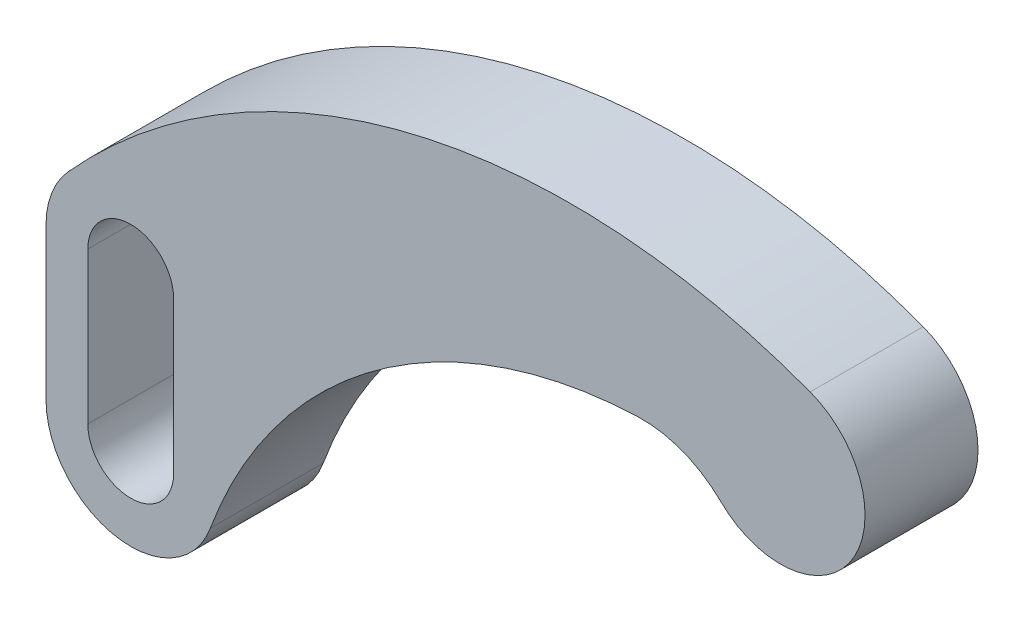
ISO-10303-21;
HEADER;
FILE_DESCRIPTION(('STEP AP214'),'2;1');
FILE_NAME('part.step','',(''),(''),'','','');
FILE_SCHEMA(('AUTOMOTIVE_DESIGN { 1 0 10303 214 1 1 1 1 }'));
ENDSEC;
DATA;
#1=APPLICATION_CONTEXT('core data for automotive mechanical design processes');
#2=APPLICATION_PROTOCOL_DEFINITION('international standard','automotive_design',2000,#1);
#3=PRODUCT_CONTEXT('',#1,'mechanical');
#4=PRODUCT('Part','Part','',(#3));
#5=PRODUCT_RELATED_PRODUCT_CATEGORY('part','',(#4));
#6=PRODUCT_DEFINITION_FORMATION('','',#4);
#7=PRODUCT_DEFINITION_CONTEXT('part definition',#1,'design');
#8=PRODUCT_DEFINITION('design','',#6,#7);
#9=PRODUCT_DEFINITION_SHAPE('','',#8);
#10=(LENGTH_UNIT() NAMED_UNIT(*) SI_UNIT(.MILLI.,.METRE.));
#11=(NAMED_UNIT(*) PLANE_ANGLE_UNIT() SI_UNIT($,.RADIAN.));
#12=(NAMED_UNIT(*) SI_UNIT($,.STERADIAN.) SOLID_ANGLE_UNIT());
#13=UNCERTAINTY_MEASURE_WITH_UNIT(LENGTH_MEASURE(1.E-05),#10,'distance_accuracy_value','');
#14=(GEOMETRIC_REPRESENTATION_CONTEXT(3) GLOBAL_UNCERTAINTY_ASSIGNED_CONTEXT((#13)) GLOBAL_UNIT_ASSIGNED_CONTEXT((#10,
#11,#12)) REPRESENTATION_CONTEXT('',''));
#15=CARTESIAN_POINT('',(0.,0.,0.));
#16=DIRECTION('',(0.,0.,1.));
#17=DIRECTION('',(1.,0.,0.));
#18=AXIS2_PLACEMENT_3D('',#15,#16,#17);
#19=CARTESIAN_POINT('',(-31.1085197333464,-31.75,25.4));
#20=DIRECTION('',(0.,0.,1.));
#21=DIRECTION('',(1.,0.,0.));
#22=AXIS2_PLACEMENT_3D('',#19,#20,#21);
#23=PLANE('',#22);
#24=CARTESIAN_POINT('',(-31.1085197333464,-31.75,25.4));
#25=DIRECTION('',(0.,0.,-1.));
#26=DIRECTION('',(1.,0.,0.));
#27=AXIS2_PLACEMENT_3D('',#24,#25,#26);
#28=CIRCLE('',#27,25.4);
#29=CARTESIAN_POINT('',(-32.0676878720464,-6.36811676644734,25.4));
#30=VERTEX_POINT('',#29);
#31=CARTESIAN_POINT('',(-13.3322227428627,-13.6071428571429,25.4));
#32=VERTEX_POINT('',#31);
#33=EDGE_CURVE('E171',#30,#32,#28,.T.);
#34=ORIENTED_EDGE('',*,*,#33,.T.);
#35=CARTESIAN_POINT('',(0.,0.,25.4));
#36=DIRECTION('',(0.,0.,1.));
#37=DIRECTION('',(1.,0.,0.));
#38=AXIS2_PLACEMENT_3D('',#35,#36,#37);
#39=CIRCLE('',#38,19.05);
#40=CARTESIAN_POINT('',(6.70952497409267,17.8293234482419,25.4));
#41=VERTEX_POINT('',#40);
#42=EDGE_CURVE('E175',#32,#41,#39,.T.);
#43=ORIENTED_EDGE('',*,*,#42,.T.);
#44=CARTESIAN_POINT('',(-46.9666748186486,-124.805264137693,25.4));
#45=DIRECTION('',(0.,0.,1.));
#46=DIRECTION('',(1.,0.,0.));
#47=AXIS2_PLACEMENT_3D('',#44,#45,#46);
#48=CIRCLE('',#47,152.4);
#49=CARTESIAN_POINT('',(-160.204760740193,-22.8106765517582,25.4));
#50=VERTEX_POINT('',#49);
#51=EDGE_CURVE('E179',#41,#50,#48,.T.);
#52=ORIENTED_EDGE('',*,*,#51,.T.);
#53=CARTESIAN_POINT('',(-146.05,-35.56,25.4));
#54=DIRECTION('',(0.,0.,1.));
#55=DIRECTION('',(1.,0.,0.));
#56=AXIS2_PLACEMENT_3D('',#53,#54,#55);
#57=CIRCLE('',#56,19.05);
#58=CARTESIAN_POINT('',(-165.1,-35.56,25.4));
#59=VERTEX_POINT('',#58);
#60=EDGE_CURVE('E182',#50,#59,#57,.T.);
#61=ORIENTED_EDGE('',*,*,#60,.T.);
#62=DIRECTION('',(0.,-1.,0.));
#63=VECTOR('',#62,1.);
#64=CARTESIAN_POINT('',(-165.1,-69.596,25.4));
#65=LINE('',#64,#63);
#66=CARTESIAN_POINT('',(-165.1,-69.596,25.4));
#67=VERTEX_POINT('',#66);
#68=EDGE_CURVE('E185',#59,#67,#65,.T.);
#69=ORIENTED_EDGE('',*,*,#68,.T.);
#70=CARTESIAN_POINT('',(-146.05,-69.596,25.4));
#71=DIRECTION('',(0.,0.,1.));
#72=DIRECTION('',(1.,0.,0.));
#73=AXIS2_PLACEMENT_3D('',#70,#71,#72);
#74=CIRCLE('',#73,19.05);
#75=CARTESIAN_POINT('',(-128.169572983258,-76.1681252041468,25.4));
#76=VERTEX_POINT('',#75);
#77=EDGE_CURVE('E188',#67,#76,#74,.T.);
#78=ORIENTED_EDGE('',*,*,#77,.T.);
#79=CARTESIAN_POINT('',(-28.0391816895061,-112.972026347369,25.4));
#80=DIRECTION('',(0.,0.,-1.));
#81=DIRECTION('',(1.,0.,0.));
#82=AXIS2_PLACEMENT_3D('',#79,#80,#81);
#83=CIRCLE('',#82,106.68);
#84=EDGE_CURVE('E191',#76,#30,#83,.T.);
#85=ORIENTED_EDGE('',*,*,#84,.T.);
#86=EDGE_LOOP('',(#34,#43,#52,#61,#69,#78,#85));
#87=FACE_BOUND('',#86,.T.);
#88=DIRECTION('',(0.,-1.,0.));
#89=VECTOR('',#88,1.);
#90=CARTESIAN_POINT('',(-155.702,-35.56,25.4));
#91=LINE('',#90,#89);
#92=CARTESIAN_POINT('',(-155.702,-35.56,25.4));
#93=VERTEX_POINT('',#92);
#94=CARTESIAN_POINT('',(-155.702,-69.596,25.4));
#95=VERTEX_POINT('',#94);
#96=EDGE_CURVE('E132',#93,#95,#91,.T.);
#97=ORIENTED_EDGE('',*,*,#96,.F.);
#98=CARTESIAN_POINT('',(-146.05,-35.56,25.4));
#99=DIRECTION('',(0.,0.,1.));
#100=DIRECTION('',(1.,0.,0.));
#101=AXIS2_PLACEMENT_3D('',#98,#99,#100);
#102=CIRCLE('',#101,9.65199999999999);
#103=CARTESIAN_POINT('',(-136.398,-35.56,25.4));
#104=VERTEX_POINT('',#103);
#105=EDGE_CURVE('E123',#104,#93,#102,.T.);
#106=ORIENTED_EDGE('',*,*,#105,.F.);
#107=DIRECTION('',(0.,1.,0.));
#108=VECTOR('',#107,1.);
#109=CARTESIAN_POINT('',(-136.398,-35.56,25.4));
#110=LINE('',#109,#108);
#111=CARTESIAN_POINT('',(-136.398,-69.596,25.4));
#112=VERTEX_POINT('',#111);
#113=EDGE_CURVE('E149',#112,#104,#110,.T.);
#114=ORIENTED_EDGE('',*,*,#113,.F.);
#115=CARTESIAN_POINT('',(-146.05,-69.596,25.4));
#116=DIRECTION('',(0.,0.,1.));
#117=DIRECTION('',(1.,0.,0.));
#118=AXIS2_PLACEMENT_3D('',#115,#116,#117);
#119=CIRCLE('',#118,9.65199999999999);
#120=EDGE_CURVE('E145',#95,#112,#119,.T.);
#121=ORIENTED_EDGE('',*,*,#120,.F.);
#122=EDGE_LOOP('',(#97,#106,#114,#121));
#123=FACE_BOUND('',#122,.T.);
#124=ADVANCED_FACE('F39',(#87,#123),#23,.T.);
#125=CARTESIAN_POINT('',(-31.1085197333464,-31.75,0.));
#126=DIRECTION('',(0.,0.,1.));
#127=DIRECTION('',(1.,0.,0.));
#128=AXIS2_PLACEMENT_3D('',#125,#126,#127);
#129=PLANE('',#128);
#130=CARTESIAN_POINT('',(-31.1085197333464,-31.75,0.));
#131=DIRECTION('',(0.,0.,-1.));
#132=DIRECTION('',(1.,0.,0.));
#133=AXIS2_PLACEMENT_3D('',#130,#131,#132);
#134=CIRCLE('',#133,25.4);
#135=CARTESIAN_POINT('',(-32.0676878720464,-6.36811676644734,0.));
#136=VERTEX_POINT('',#135);
#137=CARTESIAN_POINT('',(-13.3322227428627,-13.6071428571429,0.));
#138=VERTEX_POINT('',#137);
#139=EDGE_CURVE('E141',#136,#138,#134,.T.);
#140=ORIENTED_EDGE('',*,*,#139,.F.);
#141=CARTESIAN_POINT('',(-28.0391816895061,-112.972026347369,0.));
#142=DIRECTION('',(0.,0.,-1.));
#143=DIRECTION('',(1.,0.,0.));
#144=AXIS2_PLACEMENT_3D('',#141,#142,#143);
#145=CIRCLE('',#144,106.68);
#146=CARTESIAN_POINT('',(-128.169572983258,-76.1681252041468,0.));
#147=VERTEX_POINT('',#146);
#148=EDGE_CURVE('E176',#147,#136,#145,.T.);
#149=ORIENTED_EDGE('',*,*,#148,.F.);
#150=CARTESIAN_POINT('',(-146.05,-69.596,0.));
#151=DIRECTION('',(0.,0.,1.));
#152=DIRECTION('',(1.,0.,0.));
#153=AXIS2_PLACEMENT_3D('',#150,#151,#152);
#154=CIRCLE('',#153,19.05);
#155=CARTESIAN_POINT('',(-165.1,-69.596,0.));
#156=VERTEX_POINT('',#155);
#157=EDGE_CURVE('E210',#156,#147,#154,.T.);
#158=ORIENTED_EDGE('',*,*,#157,.F.);
#159=DIRECTION('',(0.,-1.,0.));
#160=VECTOR('',#159,1.);
#161=CARTESIAN_POINT('',(-165.1,-69.596,0.));
#162=LINE('',#161,#160);
#163=CARTESIAN_POINT('',(-165.1,-35.56,0.));
#164=VERTEX_POINT('',#163);
#165=EDGE_CURVE('E207',#164,#156,#162,.T.);
#166=ORIENTED_EDGE('',*,*,#165,.F.);
#167=CARTESIAN_POINT('',(-146.05,-35.56,0.));
#168=DIRECTION('',(0.,0.,1.));
#169=DIRECTION('',(1.,0.,0.));
#170=AXIS2_PLACEMENT_3D('',#167,#168,#169);
#171=CIRCLE('',#170,19.05);
#172=CARTESIAN_POINT('',(-160.204760740193,-22.8106765517582,0.));
#173=VERTEX_POINT('',#172);
#174=EDGE_CURVE('E204',#173,#164,#171,.T.);
#175=ORIENTED_EDGE('',*,*,#174,.F.);
#176=CARTESIAN_POINT('',(-46.9666748186486,-124.805264137693,0.));
#177=DIRECTION('',(0.,0.,1.));
#178=DIRECTION('',(1.,0.,0.));
#179=AXIS2_PLACEMENT_3D('',#176,#177,#178);
#180=CIRCLE('',#179,152.4);
#181=CARTESIAN_POINT('',(6.70952497409267,17.8293234482419,0.));
#182=VERTEX_POINT('',#181);
#183=EDGE_CURVE('E201',#182,#173,#180,.T.);
#184=ORIENTED_EDGE('',*,*,#183,.F.);
#185=CARTESIAN_POINT('',(0.,0.,0.));
#186=DIRECTION('',(0.,0.,1.));
#187=DIRECTION('',(1.,0.,0.));
#188=AXIS2_PLACEMENT_3D('',#185,#186,#187);
#189=CIRCLE('',#188,19.05);
#190=EDGE_CURVE('E198',#138,#182,#189,.T.);
#191=ORIENTED_EDGE('',*,*,#190,.F.);
#192=EDGE_LOOP('',(#140,#149,#158,#166,#175,#184,#191));
#193=FACE_BOUND('',#192,.T.);
#194=CARTESIAN_POINT('',(-146.05,-35.56,0.));
#195=DIRECTION('',(0.,0.,1.));
#196=DIRECTION('',(1.,0.,0.));
#197=AXIS2_PLACEMENT_3D('',#194,#195,#196);
#198=CIRCLE('',#197,9.65199999999999);
#199=CARTESIAN_POINT('',(-136.398,-35.56,0.));
#200=VERTEX_POINT('',#199);
#201=CARTESIAN_POINT('',(-155.702,-35.56,0.));
#202=VERTEX_POINT('',#201);
#203=EDGE_CURVE('E63',#200,#202,#198,.T.);
#204=ORIENTED_EDGE('',*,*,#203,.T.);
#205=DIRECTION('',(0.,-1.,0.));
#206=VECTOR('',#205,1.);
#207=CARTESIAN_POINT('',(-155.702,-35.56,0.));
#208=LINE('',#207,#206);
#209=CARTESIAN_POINT('',(-155.702,-69.596,0.));
#210=VERTEX_POINT('',#209);
#211=EDGE_CURVE('E139',#202,#210,#208,.T.);
#212=ORIENTED_EDGE('',*,*,#211,.T.);
#213=CARTESIAN_POINT('',(-146.05,-69.596,0.));
#214=DIRECTION('',(0.,0.,1.));
#215=DIRECTION('',(1.,0.,0.));
#216=AXIS2_PLACEMENT_3D('',#213,#214,#215);
#217=CIRCLE('',#216,9.65199999999999);
#218=CARTESIAN_POINT('',(-136.398,-69.596,0.));
#219=VERTEX_POINT('',#218);
#220=EDGE_CURVE('E158',#210,#219,#217,.T.);
#221=ORIENTED_EDGE('',*,*,#220,.T.);
#222=DIRECTION('',(0.,1.,0.));
#223=VECTOR('',#222,1.);
#224=CARTESIAN_POINT('',(-136.398,-35.56,0.));
#225=LINE('',#224,#223);
#226=EDGE_CURVE('E133',#219,#200,#225,.T.);
#227=ORIENTED_EDGE('',*,*,#226,.T.);
#228=EDGE_LOOP('',(#204,#212,#221,#227));
#229=FACE_BOUND('',#228,.T.);
#230=ADVANCED_FACE('F245',(#193,#229),#129,.F.);
#231=CARTESIAN_POINT('',(-31.1085197333464,-31.75,25.4));
#232=DIRECTION('',(0.,0.,-1.));
#233=DIRECTION('',(-1.,0.,0.));
#234=AXIS2_PLACEMENT_3D('',#231,#232,#233);
#235=CYLINDRICAL_SURFACE('',#234,25.4);
#236=ORIENTED_EDGE('',*,*,#139,.T.);
#237=DIRECTION('',(0.,0.,-1.));
#238=VECTOR('',#237,1.);
#239=CARTESIAN_POINT('',(-13.3322227428627,-13.6071428571429,25.4));
#240=LINE('',#239,#238);
#241=EDGE_CURVE('E11',#32,#138,#240,.T.);
#242=ORIENTED_EDGE('',*,*,#241,.F.);
#243=ORIENTED_EDGE('',*,*,#33,.F.);
#244=DIRECTION('',(0.,0.,-1.));
#245=VECTOR('',#244,1.);
#246=CARTESIAN_POINT('',(-32.0676878720464,-6.36811676644734,25.4));
#247=LINE('',#246,#245);
#248=EDGE_CURVE('E194',#30,#136,#247,.T.);
#249=ORIENTED_EDGE('',*,*,#248,.T.);
#250=EDGE_LOOP('',(#236,#242,#243,#249));
#251=FACE_BOUND('',#250,.T.);
#252=ADVANCED_FACE('F41',(#251),#235,.F.);
#253=CARTESIAN_POINT('',(0.,0.,25.4));
#254=DIRECTION('',(0.,0.,-1.));
#255=DIRECTION('',(-1.,0.,0.));
#256=AXIS2_PLACEMENT_3D('',#253,#254,#255);
#257=CYLINDRICAL_SURFACE('',#256,19.05);
#258=ORIENTED_EDGE('',*,*,#190,.T.);
#259=DIRECTION('',(0.,0.,-1.));
#260=VECTOR('',#259,1.);
#261=CARTESIAN_POINT('',(6.70952497409267,17.8293234482419,25.4));
#262=LINE('',#261,#260);
#263=EDGE_CURVE('E48',#41,#182,#262,.T.);
#264=ORIENTED_EDGE('',*,*,#263,.F.);
#265=ORIENTED_EDGE('',*,*,#42,.F.);
#266=ORIENTED_EDGE('',*,*,#241,.T.);
#267=EDGE_LOOP('',(#258,#264,#265,#266));
#268=FACE_BOUND('',#267,.T.);
#269=ADVANCED_FACE('F262',(#268),#257,.T.);
#270=CARTESIAN_POINT('',(-46.9666748186486,-124.805264137693,25.4));
#271=DIRECTION('',(0.,0.,-1.));
#272=DIRECTION('',(-1.,0.,0.));
#273=AXIS2_PLACEMENT_3D('',#270,#271,#272);
#274=CYLINDRICAL_SURFACE('',#273,152.4);
#275=ORIENTED_EDGE('',*,*,#183,.T.);
#276=DIRECTION('',(0.,0.,-1.));
#277=VECTOR('',#276,1.);
#278=CARTESIAN_POINT('',(-160.204760740193,-22.8106765517582,25.4));
#279=LINE('',#278,#277);
#280=EDGE_CURVE('E230',#50,#173,#279,.T.);
#281=ORIENTED_EDGE('',*,*,#280,.F.);
#282=ORIENTED_EDGE('',*,*,#51,.F.);
#283=ORIENTED_EDGE('',*,*,#263,.T.);
#284=EDGE_LOOP('',(#275,#281,#282,#283));
#285=FACE_BOUND('',#284,.T.);
#286=ADVANCED_FACE('F239',(#285),#274,.T.);
#287=CARTESIAN_POINT('',(-146.05,-35.56,25.4));
#288=DIRECTION('',(0.,0.,-1.));
#289=DIRECTION('',(-1.,0.,0.));
#290=AXIS2_PLACEMENT_3D('',#287,#288,#289);
#291=CYLINDRICAL_SURFACE('',#290,19.05);
#292=ORIENTED_EDGE('',*,*,#174,.T.);
#293=DIRECTION('',(0.,0.,-1.));
#294=VECTOR('',#293,1.);
#295=CARTESIAN_POINT('',(-165.1,-35.56,25.4));
#296=LINE('',#295,#294);
#297=EDGE_CURVE('E226',#59,#164,#296,.T.);
#298=ORIENTED_EDGE('',*,*,#297,.F.);
#299=ORIENTED_EDGE('',*,*,#60,.F.);
#300=ORIENTED_EDGE('',*,*,#280,.T.);
#301=EDGE_LOOP('',(#292,#298,#299,#300));
#302=FACE_BOUND('',#301,.T.);
#303=ADVANCED_FACE('F251',(#302),#291,.T.);
#304=CARTESIAN_POINT('',(-165.1,-69.596,25.4));
#305=DIRECTION('',(1.,0.,0.));
#306=DIRECTION('',(0.,0.,-1.));
#307=AXIS2_PLACEMENT_3D('',#304,#305,#306);
#308=PLANE('',#307);
#309=ORIENTED_EDGE('',*,*,#165,.T.);
#310=DIRECTION('',(0.,0.,-1.));
#311=VECTOR('',#310,1.);
#312=CARTESIAN_POINT('',(-165.1,-69.596,25.4));
#313=LINE('',#312,#311);
#314=EDGE_CURVE('E222',#67,#156,#313,.T.);
#315=ORIENTED_EDGE('',*,*,#314,.F.);
#316=ORIENTED_EDGE('',*,*,#68,.F.);
#317=ORIENTED_EDGE('',*,*,#297,.T.);
#318=EDGE_LOOP('',(#309,#315,#316,#317));
#319=FACE_BOUND('',#318,.T.);
#320=ADVANCED_FACE('F255',(#319),#308,.F.);
#321=CARTESIAN_POINT('',(-146.05,-69.596,25.4));
#322=DIRECTION('',(0.,0.,-1.));
#323=DIRECTION('',(-1.,0.,0.));
#324=AXIS2_PLACEMENT_3D('',#321,#322,#323);
#325=CYLINDRICAL_SURFACE('',#324,19.05);
#326=ORIENTED_EDGE('',*,*,#157,.T.);
#327=DIRECTION('',(0.,0.,-1.));
#328=VECTOR('',#327,1.);
#329=CARTESIAN_POINT('',(-128.169572983258,-76.1681252041468,25.4));
#330=LINE('',#329,#328);
#331=EDGE_CURVE('E218',#76,#147,#330,.T.);
#332=ORIENTED_EDGE('',*,*,#331,.F.);
#333=ORIENTED_EDGE('',*,*,#77,.F.);
#334=ORIENTED_EDGE('',*,*,#314,.T.);
#335=EDGE_LOOP('',(#326,#332,#333,#334));
#336=FACE_BOUND('',#335,.T.);
#337=ADVANCED_FACE('F270',(#336),#325,.T.);
#338=CARTESIAN_POINT('',(-28.0391816895061,-112.972026347369,25.4));
#339=DIRECTION('',(0.,0.,-1.));
#340=DIRECTION('',(-1.,0.,0.));
#341=AXIS2_PLACEMENT_3D('',#338,#339,#340);
#342=CYLINDRICAL_SURFACE('',#341,106.68);
#343=ORIENTED_EDGE('',*,*,#148,.T.);
#344=ORIENTED_EDGE('',*,*,#248,.F.);
#345=ORIENTED_EDGE('',*,*,#84,.F.);
#346=ORIENTED_EDGE('',*,*,#331,.T.);
#347=EDGE_LOOP('',(#343,#344,#345,#346));
#348=FACE_BOUND('',#347,.T.);
#349=ADVANCED_FACE('F267',(#348),#342,.F.);
#350=CARTESIAN_POINT('',(-146.05,-35.56,25.4));
#351=DIRECTION('',(0.,0.,-1.));
#352=DIRECTION('',(-1.,0.,0.));
#353=AXIS2_PLACEMENT_3D('',#350,#351,#352);
#354=CYLINDRICAL_SURFACE('',#353,9.65199999999999);
#355=ORIENTED_EDGE('',*,*,#203,.F.);
#356=DIRECTION('',(0.,0.,-1.));
#357=VECTOR('',#356,1.);
#358=CARTESIAN_POINT('',(-136.398,-35.56,25.4));
#359=LINE('',#358,#357);
#360=EDGE_CURVE('E127',#104,#200,#359,.T.);
#361=ORIENTED_EDGE('',*,*,#360,.F.);
#362=ORIENTED_EDGE('',*,*,#105,.T.);
#363=DIRECTION('',(0.,0.,-1.));
#364=VECTOR('',#363,1.);
#365=CARTESIAN_POINT('',(-155.702,-35.56,25.4));
#366=LINE('',#365,#364);
#367=EDGE_CURVE('E126',#93,#202,#366,.T.);
#368=ORIENTED_EDGE('',*,*,#367,.T.);
#369=EDGE_LOOP('',(#355,#361,#362,#368));
#370=FACE_BOUND('',#369,.T.);
#371=ADVANCED_FACE('F125',(#370),#354,.F.);
#372=CARTESIAN_POINT('',(-155.702,-35.56,25.4));
#373=DIRECTION('',(1.,0.,0.));
#374=DIRECTION('',(0.,0.,-1.));
#375=AXIS2_PLACEMENT_3D('',#372,#373,#374);
#376=PLANE('',#375);
#377=ORIENTED_EDGE('',*,*,#211,.F.);
#378=ORIENTED_EDGE('',*,*,#367,.F.);
#379=ORIENTED_EDGE('',*,*,#96,.T.);
#380=DIRECTION('',(0.,0.,-1.));
#381=VECTOR('',#380,1.);
#382=CARTESIAN_POINT('',(-155.702,-69.596,25.4));
#383=LINE('',#382,#381);
#384=EDGE_CURVE('E142',#95,#210,#383,.T.);
#385=ORIENTED_EDGE('',*,*,#384,.T.);
#386=EDGE_LOOP('',(#377,#378,#379,#385));
#387=FACE_BOUND('',#386,.T.);
#388=ADVANCED_FACE('F136',(#387),#376,.T.);
#389=CARTESIAN_POINT('',(-146.05,-69.596,25.4));
#390=DIRECTION('',(0.,0.,-1.));
#391=DIRECTION('',(-1.,0.,0.));
#392=AXIS2_PLACEMENT_3D('',#389,#390,#391);
#393=CYLINDRICAL_SURFACE('',#392,9.65199999999999);
#394=ORIENTED_EDGE('',*,*,#220,.F.);
#395=ORIENTED_EDGE('',*,*,#384,.F.);
#396=ORIENTED_EDGE('',*,*,#120,.T.);
#397=DIRECTION('',(0.,0.,-1.));
#398=VECTOR('',#397,1.);
#399=CARTESIAN_POINT('',(-136.398,-69.596,25.4));
#400=LINE('',#399,#398);
#401=EDGE_CURVE('E55',#112,#219,#400,.T.);
#402=ORIENTED_EDGE('',*,*,#401,.T.);
#403=EDGE_LOOP('',(#394,#395,#396,#402));
#404=FACE_BOUND('',#403,.T.);
#405=ADVANCED_FACE('F290',(#404),#393,.F.);
#406=CARTESIAN_POINT('',(-136.398,-35.56,25.4));
#407=DIRECTION('',(-1.,0.,0.));
#408=DIRECTION('',(0.,0.,1.));
#409=AXIS2_PLACEMENT_3D('',#406,#407,#408);
#410=PLANE('',#409);
#411=ORIENTED_EDGE('',*,*,#226,.F.);
#412=ORIENTED_EDGE('',*,*,#401,.F.);
#413=ORIENTED_EDGE('',*,*,#113,.T.);
#414=ORIENTED_EDGE('',*,*,#360,.T.);
#415=EDGE_LOOP('',(#411,#412,#413,#414));
#416=FACE_BOUND('',#415,.T.);
#417=ADVANCED_FACE('F293',(#416),#410,.T.);
#418=CLOSED_SHELL('',(#124,#230,#252,#269,#286,#303,#320,#337,#349,#371,#388,#405,#417));
#419=MANIFOLD_SOLID_BREP('B2',#418);
#420=ADVANCED_BREP_SHAPE_REPRESENTATION('',(#18,#419),#14);
#421=SHAPE_DEFINITION_REPRESENTATION(#9,#420);
ENDSEC;
END-ISO-10303-21;
